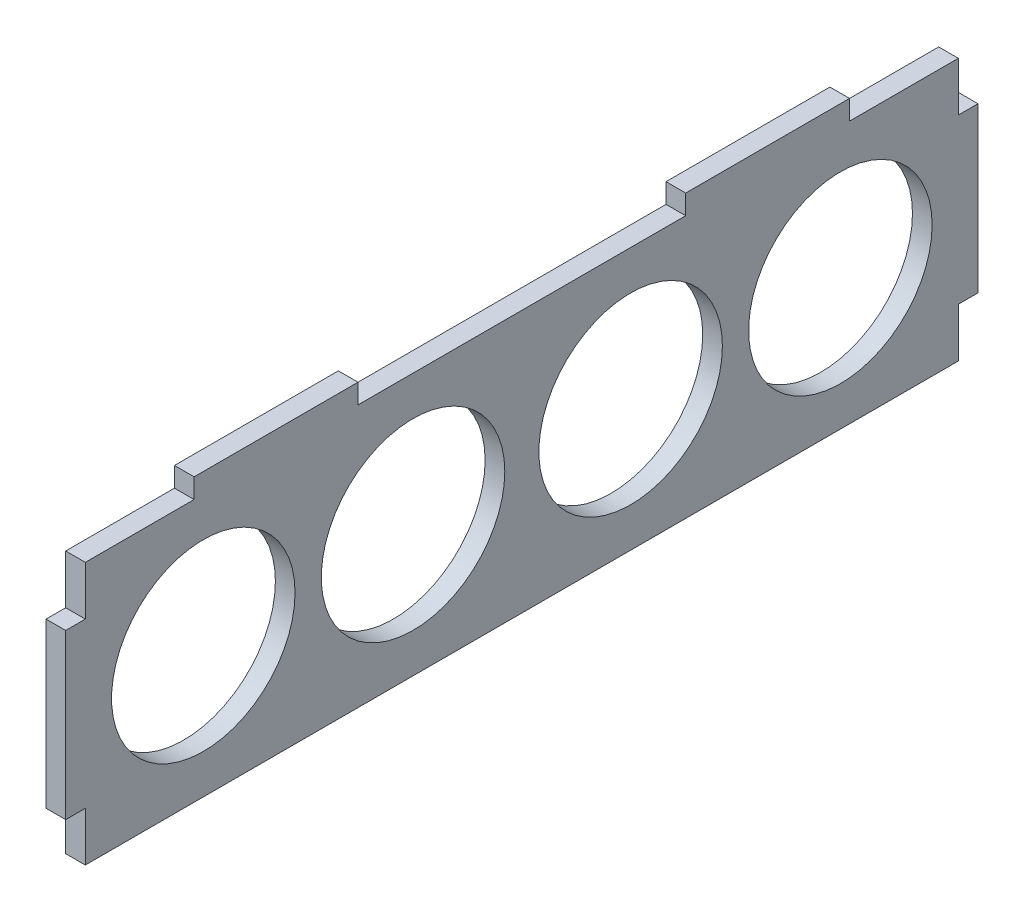
ISO-10303-21;
HEADER;
FILE_DESCRIPTION(('STEP AP214'),'2;1');
FILE_NAME('part.step','',(''),(''),'','','');
FILE_SCHEMA(('AUTOMOTIVE_DESIGN { 1 0 10303 214 1 1 1 1 }'));
ENDSEC;
DATA;
#1=APPLICATION_CONTEXT('core data for automotive mechanical design processes');
#2=APPLICATION_PROTOCOL_DEFINITION('international standard','automotive_design',2000,#1);
#3=PRODUCT_CONTEXT('',#1,'mechanical');
#4=PRODUCT('Part','Part','',(#3));
#5=PRODUCT_RELATED_PRODUCT_CATEGORY('part','',(#4));
#6=PRODUCT_DEFINITION_FORMATION('','',#4);
#7=PRODUCT_DEFINITION_CONTEXT('part definition',#1,'design');
#8=PRODUCT_DEFINITION('design','',#6,#7);
#9=PRODUCT_DEFINITION_SHAPE('','',#8);
#10=(LENGTH_UNIT() NAMED_UNIT(*) SI_UNIT(.MILLI.,.METRE.));
#11=(NAMED_UNIT(*) PLANE_ANGLE_UNIT() SI_UNIT($,.RADIAN.));
#12=(NAMED_UNIT(*) SI_UNIT($,.STERADIAN.) SOLID_ANGLE_UNIT());
#13=UNCERTAINTY_MEASURE_WITH_UNIT(LENGTH_MEASURE(1.E-05),#10,'distance_accuracy_value','');
#14=(GEOMETRIC_REPRESENTATION_CONTEXT(3) GLOBAL_UNCERTAINTY_ASSIGNED_CONTEXT((#13)) GLOBAL_UNIT_ASSIGNED_CONTEXT((#10,
#11,#12)) REPRESENTATION_CONTEXT('',''));
#15=CARTESIAN_POINT('',(0.,0.,0.));
#16=DIRECTION('',(0.,0.,1.));
#17=DIRECTION('',(1.,0.,0.));
#18=AXIS2_PLACEMENT_3D('',#15,#16,#17);
#19=CARTESIAN_POINT('',(3.,-20.,0.));
#20=DIRECTION('',(0.,1.,0.));
#21=DIRECTION('',(0.,0.,1.));
#22=AXIS2_PLACEMENT_3D('',#19,#20,#21);
#23=PLANE('',#22);
#24=DIRECTION('',(0.,0.,-1.));
#25=VECTOR('',#24,1.);
#26=CARTESIAN_POINT('',(0.,-20.,0.));
#27=LINE('',#26,#25);
#28=CARTESIAN_POINT('',(0.,-20.,66.6));
#29=VERTEX_POINT('',#28);
#30=CARTESIAN_POINT('',(0.,-20.,-66.6));
#31=VERTEX_POINT('',#30);
#32=EDGE_CURVE('E222',#29,#31,#27,.T.);
#33=ORIENTED_EDGE('',*,*,#32,.T.);
#34=DIRECTION('',(-1.,0.,0.));
#35=VECTOR('',#34,1.);
#36=CARTESIAN_POINT('',(3.,-20.,-66.6));
#37=LINE('',#36,#35);
#38=CARTESIAN_POINT('',(3.,-20.,-66.6));
#39=VERTEX_POINT('',#38);
#40=EDGE_CURVE('E11',#39,#31,#37,.T.);
#41=ORIENTED_EDGE('',*,*,#40,.F.);
#42=DIRECTION('',(0.,0.,-1.));
#43=VECTOR('',#42,1.);
#44=CARTESIAN_POINT('',(3.,-20.,0.));
#45=LINE('',#44,#43);
#46=CARTESIAN_POINT('',(3.,-20.,66.6));
#47=VERTEX_POINT('',#46);
#48=EDGE_CURVE('E674',#47,#39,#45,.T.);
#49=ORIENTED_EDGE('',*,*,#48,.F.);
#50=DIRECTION('',(-1.,0.,0.));
#51=VECTOR('',#50,1.);
#52=CARTESIAN_POINT('',(3.,-20.,66.6));
#53=LINE('',#52,#51);
#54=EDGE_CURVE('E55',#47,#29,#53,.T.);
#55=ORIENTED_EDGE('',*,*,#54,.T.);
#56=EDGE_LOOP('',(#33,#41,#49,#55));
#57=FACE_BOUND('',#56,.T.);
#58=ADVANCED_FACE('F38',(#57),#23,.F.);
#59=CARTESIAN_POINT('',(3.,0.,-66.6));
#60=DIRECTION('',(0.,0.,1.));
#61=DIRECTION('',(1.,0.,0.));
#62=AXIS2_PLACEMENT_3D('',#59,#60,#61);
#63=PLANE('',#62);
#64=DIRECTION('',(0.,1.,0.));
#65=VECTOR('',#64,1.);
#66=CARTESIAN_POINT('',(0.,0.,-66.6));
#67=LINE('',#66,#65);
#68=CARTESIAN_POINT('',(0.,-12.5,-66.6));
#69=VERTEX_POINT('',#68);
#70=EDGE_CURVE('E224',#31,#69,#67,.T.);
#71=ORIENTED_EDGE('',*,*,#70,.T.);
#72=DIRECTION('',(-1.,0.,0.));
#73=VECTOR('',#72,1.);
#74=CARTESIAN_POINT('',(3.,-12.5,-66.6));
#75=LINE('',#74,#73);
#76=CARTESIAN_POINT('',(3.,-12.5,-66.6));
#77=VERTEX_POINT('',#76);
#78=EDGE_CURVE('E47',#77,#69,#75,.T.);
#79=ORIENTED_EDGE('',*,*,#78,.F.);
#80=DIRECTION('',(0.,1.,0.));
#81=VECTOR('',#80,1.);
#82=CARTESIAN_POINT('',(3.,0.,-66.6));
#83=LINE('',#82,#81);
#84=EDGE_CURVE('E129',#39,#77,#83,.T.);
#85=ORIENTED_EDGE('',*,*,#84,.F.);
#86=ORIENTED_EDGE('',*,*,#40,.T.);
#87=EDGE_LOOP('',(#71,#79,#85,#86));
#88=FACE_BOUND('',#87,.T.);
#89=ADVANCED_FACE('F390',(#88),#63,.F.);
#90=CARTESIAN_POINT('',(3.,-12.5,0.));
#91=DIRECTION('',(0.,1.,0.));
#92=DIRECTION('',(0.,0.,1.));
#93=AXIS2_PLACEMENT_3D('',#90,#91,#92);
#94=PLANE('',#93);
#95=DIRECTION('',(0.,0.,-1.));
#96=VECTOR('',#95,1.);
#97=CARTESIAN_POINT('',(0.,-12.5,0.));
#98=LINE('',#97,#96);
#99=CARTESIAN_POINT('',(0.,-12.5,-69.6));
#100=VERTEX_POINT('',#99);
#101=EDGE_CURVE('E226',#69,#100,#98,.T.);
#102=ORIENTED_EDGE('',*,*,#101,.T.);
#103=DIRECTION('',(-1.,0.,0.));
#104=VECTOR('',#103,1.);
#105=CARTESIAN_POINT('',(3.,-12.5,-69.6));
#106=LINE('',#105,#104);
#107=CARTESIAN_POINT('',(3.,-12.5,-69.6));
#108=VERTEX_POINT('',#107);
#109=EDGE_CURVE('E297',#108,#100,#106,.T.);
#110=ORIENTED_EDGE('',*,*,#109,.F.);
#111=DIRECTION('',(0.,0.,-1.));
#112=VECTOR('',#111,1.);
#113=CARTESIAN_POINT('',(3.,-12.5,0.));
#114=LINE('',#113,#112);
#115=EDGE_CURVE('E304',#77,#108,#114,.T.);
#116=ORIENTED_EDGE('',*,*,#115,.F.);
#117=ORIENTED_EDGE('',*,*,#78,.T.);
#118=EDGE_LOOP('',(#102,#110,#116,#117));
#119=FACE_BOUND('',#118,.T.);
#120=ADVANCED_FACE('F302',(#119),#94,.F.);
#121=CARTESIAN_POINT('',(3.,0.,-69.6));
#122=DIRECTION('',(0.,0.,-1.));
#123=DIRECTION('',(-1.,0.,0.));
#124=AXIS2_PLACEMENT_3D('',#121,#122,#123);
#125=PLANE('',#124);
#126=DIRECTION('',(0.,-1.,0.));
#127=VECTOR('',#126,1.);
#128=CARTESIAN_POINT('',(0.,0.,-69.6));
#129=LINE('',#128,#127);
#130=CARTESIAN_POINT('',(0.,12.5,-69.6));
#131=VERTEX_POINT('',#130);
#132=EDGE_CURVE('E230',#131,#100,#129,.T.);
#133=ORIENTED_EDGE('',*,*,#132,.F.);
#134=DIRECTION('',(-1.,0.,0.));
#135=VECTOR('',#134,1.);
#136=CARTESIAN_POINT('',(3.,12.5,-69.6));
#137=LINE('',#136,#135);
#138=CARTESIAN_POINT('',(3.,12.5,-69.6));
#139=VERTEX_POINT('',#138);
#140=EDGE_CURVE('E295',#139,#131,#137,.T.);
#141=ORIENTED_EDGE('',*,*,#140,.F.);
#142=DIRECTION('',(0.,-1.,0.));
#143=VECTOR('',#142,1.);
#144=CARTESIAN_POINT('',(3.,0.,-69.6));
#145=LINE('',#144,#143);
#146=EDGE_CURVE('E314',#139,#108,#145,.T.);
#147=ORIENTED_EDGE('',*,*,#146,.T.);
#148=ORIENTED_EDGE('',*,*,#109,.T.);
#149=EDGE_LOOP('',(#133,#141,#147,#148));
#150=FACE_BOUND('',#149,.T.);
#151=ADVANCED_FACE('F311',(#150),#125,.T.);
#152=CARTESIAN_POINT('',(3.,12.5,0.));
#153=DIRECTION('',(0.,1.,0.));
#154=DIRECTION('',(0.,0.,1.));
#155=AXIS2_PLACEMENT_3D('',#152,#153,#154);
#156=PLANE('',#155);
#157=DIRECTION('',(0.,0.,-1.));
#158=VECTOR('',#157,1.);
#159=CARTESIAN_POINT('',(0.,12.5,0.));
#160=LINE('',#159,#158);
#161=CARTESIAN_POINT('',(0.,12.5,-66.6));
#162=VERTEX_POINT('',#161);
#163=EDGE_CURVE('E233',#162,#131,#160,.T.);
#164=ORIENTED_EDGE('',*,*,#163,.F.);
#165=DIRECTION('',(-1.,0.,0.));
#166=VECTOR('',#165,1.);
#167=CARTESIAN_POINT('',(3.,12.5,-66.6));
#168=LINE('',#167,#166);
#169=CARTESIAN_POINT('',(3.,12.5,-66.6));
#170=VERTEX_POINT('',#169);
#171=EDGE_CURVE('E293',#170,#162,#168,.T.);
#172=ORIENTED_EDGE('',*,*,#171,.F.);
#173=DIRECTION('',(0.,0.,-1.));
#174=VECTOR('',#173,1.);
#175=CARTESIAN_POINT('',(3.,12.5,0.));
#176=LINE('',#175,#174);
#177=EDGE_CURVE('E317',#170,#139,#176,.T.);
#178=ORIENTED_EDGE('',*,*,#177,.T.);
#179=ORIENTED_EDGE('',*,*,#140,.T.);
#180=EDGE_LOOP('',(#164,#172,#178,#179));
#181=FACE_BOUND('',#180,.T.);
#182=ADVANCED_FACE('F621',(#181),#156,.T.);
#183=CARTESIAN_POINT('',(0.,20.,-66.6));
#184=VERTEX_POINT('',#183);
#185=EDGE_CURVE('E227',#162,#184,#67,.T.);
#186=ORIENTED_EDGE('',*,*,#185,.T.);
#187=DIRECTION('',(-1.,0.,0.));
#188=VECTOR('',#187,1.);
#189=CARTESIAN_POINT('',(3.,20.,-66.6));
#190=LINE('',#189,#188);
#191=CARTESIAN_POINT('',(3.,20.,-66.6));
#192=VERTEX_POINT('',#191);
#193=EDGE_CURVE('E291',#192,#184,#190,.T.);
#194=ORIENTED_EDGE('',*,*,#193,.F.);
#195=EDGE_CURVE('E319',#170,#192,#83,.T.);
#196=ORIENTED_EDGE('',*,*,#195,.F.);
#197=ORIENTED_EDGE('',*,*,#171,.T.);
#198=EDGE_LOOP('',(#186,#194,#196,#197));
#199=FACE_BOUND('',#198,.T.);
#200=ADVANCED_FACE('F396',(#199),#63,.F.);
#201=CARTESIAN_POINT('',(3.,20.,0.));
#202=DIRECTION('',(0.,1.,0.));
#203=DIRECTION('',(0.,0.,1.));
#204=AXIS2_PLACEMENT_3D('',#201,#202,#203);
#205=PLANE('',#204);
#206=DIRECTION('',(0.,0.,-1.));
#207=VECTOR('',#206,1.);
#208=CARTESIAN_POINT('',(0.,20.,0.));
#209=LINE('',#208,#207);
#210=CARTESIAN_POINT('',(0.,20.,-50.));
#211=VERTEX_POINT('',#210);
#212=EDGE_CURVE('E236',#211,#184,#209,.T.);
#213=ORIENTED_EDGE('',*,*,#212,.F.);
#214=DIRECTION('',(-1.,0.,0.));
#215=VECTOR('',#214,1.);
#216=CARTESIAN_POINT('',(3.,20.,-50.));
#217=LINE('',#216,#215);
#218=CARTESIAN_POINT('',(3.,20.,-50.));
#219=VERTEX_POINT('',#218);
#220=EDGE_CURVE('E289',#219,#211,#217,.T.);
#221=ORIENTED_EDGE('',*,*,#220,.F.);
#222=DIRECTION('',(0.,0.,-1.));
#223=VECTOR('',#222,1.);
#224=CARTESIAN_POINT('',(3.,20.,0.));
#225=LINE('',#224,#223);
#226=EDGE_CURVE('E324',#219,#192,#225,.T.);
#227=ORIENTED_EDGE('',*,*,#226,.T.);
#228=ORIENTED_EDGE('',*,*,#193,.T.);
#229=EDGE_LOOP('',(#213,#221,#227,#228));
#230=FACE_BOUND('',#229,.T.);
#231=ADVANCED_FACE('F387',(#230),#205,.T.);
#232=CARTESIAN_POINT('',(3.,0.,-50.));
#233=DIRECTION('',(0.,0.,1.));
#234=DIRECTION('',(1.,0.,0.));
#235=AXIS2_PLACEMENT_3D('',#232,#233,#234);
#236=PLANE('',#235);
#237=DIRECTION('',(0.,1.,0.));
#238=VECTOR('',#237,1.);
#239=CARTESIAN_POINT('',(0.,0.,-50.));
#240=LINE('',#239,#238);
#241=CARTESIAN_POINT('',(0.,23.,-50.));
#242=VERTEX_POINT('',#241);
#243=EDGE_CURVE('E239',#211,#242,#240,.T.);
#244=ORIENTED_EDGE('',*,*,#243,.T.);
#245=DIRECTION('',(-1.,0.,0.));
#246=VECTOR('',#245,1.);
#247=CARTESIAN_POINT('',(3.,23.,-50.));
#248=LINE('',#247,#246);
#249=CARTESIAN_POINT('',(3.,23.,-50.));
#250=VERTEX_POINT('',#249);
#251=EDGE_CURVE('E287',#250,#242,#248,.T.);
#252=ORIENTED_EDGE('',*,*,#251,.F.);
#253=DIRECTION('',(0.,1.,0.));
#254=VECTOR('',#253,1.);
#255=CARTESIAN_POINT('',(3.,0.,-50.));
#256=LINE('',#255,#254);
#257=EDGE_CURVE('E327',#219,#250,#256,.T.);
#258=ORIENTED_EDGE('',*,*,#257,.F.);
#259=ORIENTED_EDGE('',*,*,#220,.T.);
#260=EDGE_LOOP('',(#244,#252,#258,#259));
#261=FACE_BOUND('',#260,.T.);
#262=ADVANCED_FACE('F593',(#261),#236,.F.);
#263=CARTESIAN_POINT('',(3.,23.,0.));
#264=DIRECTION('',(0.,1.,0.));
#265=DIRECTION('',(0.,0.,1.));
#266=AXIS2_PLACEMENT_3D('',#263,#264,#265);
#267=PLANE('',#266);
#268=DIRECTION('',(0.,0.,-1.));
#269=VECTOR('',#268,1.);
#270=CARTESIAN_POINT('',(0.,23.,0.));
#271=LINE('',#270,#269);
#272=CARTESIAN_POINT('',(0.,23.,-25.));
#273=VERTEX_POINT('',#272);
#274=EDGE_CURVE('E244',#273,#242,#271,.T.);
#275=ORIENTED_EDGE('',*,*,#274,.F.);
#276=DIRECTION('',(-1.,0.,0.));
#277=VECTOR('',#276,1.);
#278=CARTESIAN_POINT('',(3.,23.,-25.));
#279=LINE('',#278,#277);
#280=CARTESIAN_POINT('',(3.,23.,-25.));
#281=VERTEX_POINT('',#280);
#282=EDGE_CURVE('E285',#281,#273,#279,.T.);
#283=ORIENTED_EDGE('',*,*,#282,.F.);
#284=DIRECTION('',(0.,0.,-1.));
#285=VECTOR('',#284,1.);
#286=CARTESIAN_POINT('',(3.,23.,0.));
#287=LINE('',#286,#285);
#288=EDGE_CURVE('E331',#281,#250,#287,.T.);
#289=ORIENTED_EDGE('',*,*,#288,.T.);
#290=ORIENTED_EDGE('',*,*,#251,.T.);
#291=EDGE_LOOP('',(#275,#283,#289,#290));
#292=FACE_BOUND('',#291,.T.);
#293=ADVANCED_FACE('F585',(#292),#267,.T.);
#294=CARTESIAN_POINT('',(3.,0.,-25.));
#295=DIRECTION('',(0.,0.,1.));
#296=DIRECTION('',(1.,0.,0.));
#297=AXIS2_PLACEMENT_3D('',#294,#295,#296);
#298=PLANE('',#297);
#299=DIRECTION('',(0.,1.,0.));
#300=VECTOR('',#299,1.);
#301=CARTESIAN_POINT('',(0.,0.,-25.));
#302=LINE('',#301,#300);
#303=CARTESIAN_POINT('',(0.,20.,-25.));
#304=VERTEX_POINT('',#303);
#305=EDGE_CURVE('E247',#304,#273,#302,.T.);
#306=ORIENTED_EDGE('',*,*,#305,.F.);
#307=DIRECTION('',(-1.,0.,0.));
#308=VECTOR('',#307,1.);
#309=CARTESIAN_POINT('',(3.,20.,-25.));
#310=LINE('',#309,#308);
#311=CARTESIAN_POINT('',(3.,20.,-25.));
#312=VERTEX_POINT('',#311);
#313=EDGE_CURVE('E283',#312,#304,#310,.T.);
#314=ORIENTED_EDGE('',*,*,#313,.F.);
#315=DIRECTION('',(0.,1.,0.));
#316=VECTOR('',#315,1.);
#317=CARTESIAN_POINT('',(3.,0.,-25.));
#318=LINE('',#317,#316);
#319=EDGE_CURVE('E334',#312,#281,#318,.T.);
#320=ORIENTED_EDGE('',*,*,#319,.T.);
#321=ORIENTED_EDGE('',*,*,#282,.T.);
#322=EDGE_LOOP('',(#306,#314,#320,#321));
#323=FACE_BOUND('',#322,.T.);
#324=ADVANCED_FACE('F361',(#323),#298,.T.);
#325=CARTESIAN_POINT('',(0.,20.,25.));
#326=VERTEX_POINT('',#325);
#327=EDGE_CURVE('E241',#326,#304,#209,.T.);
#328=ORIENTED_EDGE('',*,*,#327,.F.);
#329=DIRECTION('',(-1.,0.,0.));
#330=VECTOR('',#329,1.);
#331=CARTESIAN_POINT('',(3.,20.,25.));
#332=LINE('',#331,#330);
#333=CARTESIAN_POINT('',(3.,20.,25.));
#334=VERTEX_POINT('',#333);
#335=EDGE_CURVE('E281',#334,#326,#332,.T.);
#336=ORIENTED_EDGE('',*,*,#335,.F.);
#337=EDGE_CURVE('E329',#334,#312,#225,.T.);
#338=ORIENTED_EDGE('',*,*,#337,.T.);
#339=ORIENTED_EDGE('',*,*,#313,.T.);
#340=EDGE_LOOP('',(#328,#336,#338,#339));
#341=FACE_BOUND('',#340,.T.);
#342=ADVANCED_FACE('F353',(#341),#205,.T.);
#343=CARTESIAN_POINT('',(3.,0.,25.));
#344=DIRECTION('',(0.,0.,1.));
#345=DIRECTION('',(1.,0.,0.));
#346=AXIS2_PLACEMENT_3D('',#343,#344,#345);
#347=PLANE('',#346);
#348=DIRECTION('',(0.,1.,0.));
#349=VECTOR('',#348,1.);
#350=CARTESIAN_POINT('',(0.,0.,25.));
#351=LINE('',#350,#349);
#352=CARTESIAN_POINT('',(0.,23.,25.));
#353=VERTEX_POINT('',#352);
#354=EDGE_CURVE('E250',#326,#353,#351,.T.);
#355=ORIENTED_EDGE('',*,*,#354,.T.);
#356=DIRECTION('',(-1.,0.,0.));
#357=VECTOR('',#356,1.);
#358=CARTESIAN_POINT('',(3.,23.,25.));
#359=LINE('',#358,#357);
#360=CARTESIAN_POINT('',(3.,23.,25.));
#361=VERTEX_POINT('',#360);
#362=EDGE_CURVE('E279',#361,#353,#359,.T.);
#363=ORIENTED_EDGE('',*,*,#362,.F.);
#364=DIRECTION('',(0.,1.,0.));
#365=VECTOR('',#364,1.);
#366=CARTESIAN_POINT('',(3.,0.,25.));
#367=LINE('',#366,#365);
#368=EDGE_CURVE('E337',#334,#361,#367,.T.);
#369=ORIENTED_EDGE('',*,*,#368,.F.);
#370=ORIENTED_EDGE('',*,*,#335,.T.);
#371=EDGE_LOOP('',(#355,#363,#369,#370));
#372=FACE_BOUND('',#371,.T.);
#373=ADVANCED_FACE('F378',(#372),#347,.F.);
#374=CARTESIAN_POINT('',(3.,23.,0.));
#375=DIRECTION('',(0.,1.,0.));
#376=DIRECTION('',(0.,0.,1.));
#377=AXIS2_PLACEMENT_3D('',#374,#375,#376);
#378=PLANE('',#377);
#379=DIRECTION('',(0.,0.,-1.));
#380=VECTOR('',#379,1.);
#381=CARTESIAN_POINT('',(0.,23.,0.));
#382=LINE('',#381,#380);
#383=CARTESIAN_POINT('',(0.,23.,50.));
#384=VERTEX_POINT('',#383);
#385=EDGE_CURVE('E253',#384,#353,#382,.T.);
#386=ORIENTED_EDGE('',*,*,#385,.F.);
#387=DIRECTION('',(-1.,0.,0.));
#388=VECTOR('',#387,1.);
#389=CARTESIAN_POINT('',(3.,23.,50.));
#390=LINE('',#389,#388);
#391=CARTESIAN_POINT('',(3.,23.,50.));
#392=VERTEX_POINT('',#391);
#393=EDGE_CURVE('E277',#392,#384,#390,.T.);
#394=ORIENTED_EDGE('',*,*,#393,.F.);
#395=DIRECTION('',(0.,0.,-1.));
#396=VECTOR('',#395,1.);
#397=CARTESIAN_POINT('',(3.,23.,0.));
#398=LINE('',#397,#396);
#399=EDGE_CURVE('E339',#392,#361,#398,.T.);
#400=ORIENTED_EDGE('',*,*,#399,.T.);
#401=ORIENTED_EDGE('',*,*,#362,.T.);
#402=EDGE_LOOP('',(#386,#394,#400,#401));
#403=FACE_BOUND('',#402,.T.);
#404=ADVANCED_FACE('F376',(#403),#378,.T.);
#405=CARTESIAN_POINT('',(3.,0.,50.));
#406=DIRECTION('',(0.,0.,1.));
#407=DIRECTION('',(1.,0.,0.));
#408=AXIS2_PLACEMENT_3D('',#405,#406,#407);
#409=PLANE('',#408);
#410=DIRECTION('',(0.,1.,0.));
#411=VECTOR('',#410,1.);
#412=CARTESIAN_POINT('',(0.,0.,50.));
#413=LINE('',#412,#411);
#414=CARTESIAN_POINT('',(0.,20.,50.));
#415=VERTEX_POINT('',#414);
#416=EDGE_CURVE('E256',#415,#384,#413,.T.);
#417=ORIENTED_EDGE('',*,*,#416,.F.);
#418=DIRECTION('',(-1.,0.,0.));
#419=VECTOR('',#418,1.);
#420=CARTESIAN_POINT('',(3.,20.,50.));
#421=LINE('',#420,#419);
#422=CARTESIAN_POINT('',(3.,20.,50.));
#423=VERTEX_POINT('',#422);
#424=EDGE_CURVE('E275',#423,#415,#421,.T.);
#425=ORIENTED_EDGE('',*,*,#424,.F.);
#426=DIRECTION('',(0.,1.,0.));
#427=VECTOR('',#426,1.);
#428=CARTESIAN_POINT('',(3.,0.,50.));
#429=LINE('',#428,#427);
#430=EDGE_CURVE('E342',#423,#392,#429,.T.);
#431=ORIENTED_EDGE('',*,*,#430,.T.);
#432=ORIENTED_EDGE('',*,*,#393,.T.);
#433=EDGE_LOOP('',(#417,#425,#431,#432));
#434=FACE_BOUND('',#433,.T.);
#435=ADVANCED_FACE('F373',(#434),#409,.T.);
#436=CARTESIAN_POINT('',(0.,20.,66.6));
#437=VERTEX_POINT('',#436);
#438=EDGE_CURVE('E240',#437,#415,#209,.T.);
#439=ORIENTED_EDGE('',*,*,#438,.F.);
#440=DIRECTION('',(-1.,0.,0.));
#441=VECTOR('',#440,1.);
#442=CARTESIAN_POINT('',(3.,20.,66.6));
#443=LINE('',#442,#441);
#444=CARTESIAN_POINT('',(3.,20.,66.6));
#445=VERTEX_POINT('',#444);
#446=EDGE_CURVE('E273',#445,#437,#443,.T.);
#447=ORIENTED_EDGE('',*,*,#446,.F.);
#448=EDGE_CURVE('E328',#445,#423,#225,.T.);
#449=ORIENTED_EDGE('',*,*,#448,.T.);
#450=ORIENTED_EDGE('',*,*,#424,.T.);
#451=EDGE_LOOP('',(#439,#447,#449,#450));
#452=FACE_BOUND('',#451,.T.);
#453=ADVANCED_FACE('F370',(#452),#205,.T.);
#454=CARTESIAN_POINT('',(3.,0.,66.6));
#455=DIRECTION('',(0.,0.,1.));
#456=DIRECTION('',(1.,0.,0.));
#457=AXIS2_PLACEMENT_3D('',#454,#455,#456);
#458=PLANE('',#457);
#459=DIRECTION('',(0.,1.,0.));
#460=VECTOR('',#459,1.);
#461=CARTESIAN_POINT('',(0.,0.,66.6));
#462=LINE('',#461,#460);
#463=CARTESIAN_POINT('',(0.,12.5,66.6));
#464=VERTEX_POINT('',#463);
#465=EDGE_CURVE('E259',#464,#437,#462,.T.);
#466=ORIENTED_EDGE('',*,*,#465,.F.);
#467=DIRECTION('',(-1.,0.,0.));
#468=VECTOR('',#467,1.);
#469=CARTESIAN_POINT('',(3.,12.5,66.6));
#470=LINE('',#469,#468);
#471=CARTESIAN_POINT('',(3.,12.5,66.6));
#472=VERTEX_POINT('',#471);
#473=EDGE_CURVE('E271',#472,#464,#470,.T.);
#474=ORIENTED_EDGE('',*,*,#473,.F.);
#475=DIRECTION('',(0.,1.,0.));
#476=VECTOR('',#475,1.);
#477=CARTESIAN_POINT('',(3.,0.,66.6));
#478=LINE('',#477,#476);
#479=EDGE_CURVE('E207',#472,#445,#478,.T.);
#480=ORIENTED_EDGE('',*,*,#479,.T.);
#481=ORIENTED_EDGE('',*,*,#446,.T.);
#482=EDGE_LOOP('',(#466,#474,#480,#481));
#483=FACE_BOUND('',#482,.T.);
#484=ADVANCED_FACE('F438',(#483),#458,.T.);
#485=CARTESIAN_POINT('',(3.,12.5,0.));
#486=DIRECTION('',(0.,-1.,0.));
#487=DIRECTION('',(0.,0.,-1.));
#488=AXIS2_PLACEMENT_3D('',#485,#486,#487);
#489=PLANE('',#488);
#490=DIRECTION('',(0.,0.,1.));
#491=VECTOR('',#490,1.);
#492=CARTESIAN_POINT('',(0.,12.5,0.));
#493=LINE('',#492,#491);
#494=CARTESIAN_POINT('',(0.,12.5,69.6));
#495=VERTEX_POINT('',#494);
#496=EDGE_CURVE('E262',#464,#495,#493,.T.);
#497=ORIENTED_EDGE('',*,*,#496,.T.);
#498=DIRECTION('',(-1.,0.,0.));
#499=VECTOR('',#498,1.);
#500=CARTESIAN_POINT('',(3.,12.5,69.6));
#501=LINE('',#500,#499);
#502=CARTESIAN_POINT('',(3.,12.5,69.6));
#503=VERTEX_POINT('',#502);
#504=EDGE_CURVE('E201',#503,#495,#501,.T.);
#505=ORIENTED_EDGE('',*,*,#504,.F.);
#506=DIRECTION('',(0.,0.,1.));
#507=VECTOR('',#506,1.);
#508=CARTESIAN_POINT('',(3.,12.5,0.));
#509=LINE('',#508,#507);
#510=EDGE_CURVE('E189',#472,#503,#509,.T.);
#511=ORIENTED_EDGE('',*,*,#510,.F.);
#512=ORIENTED_EDGE('',*,*,#473,.T.);
#513=EDGE_LOOP('',(#497,#505,#511,#512));
#514=FACE_BOUND('',#513,.T.);
#515=ADVANCED_FACE('F443',(#514),#489,.F.);
#516=CARTESIAN_POINT('',(3.,0.,69.6));
#517=DIRECTION('',(0.,0.,-1.));
#518=DIRECTION('',(-1.,0.,0.));
#519=AXIS2_PLACEMENT_3D('',#516,#517,#518);
#520=PLANE('',#519);
#521=DIRECTION('',(0.,-1.,0.));
#522=VECTOR('',#521,1.);
#523=CARTESIAN_POINT('',(0.,0.,69.6));
#524=LINE('',#523,#522);
#525=CARTESIAN_POINT('',(0.,-12.5,69.6));
#526=VERTEX_POINT('',#525);
#527=EDGE_CURVE('E198',#495,#526,#524,.T.);
#528=ORIENTED_EDGE('',*,*,#527,.T.);
#529=DIRECTION('',(-1.,0.,0.));
#530=VECTOR('',#529,1.);
#531=CARTESIAN_POINT('',(3.,-12.5,69.6));
#532=LINE('',#531,#530);
#533=CARTESIAN_POINT('',(3.,-12.5,69.6));
#534=VERTEX_POINT('',#533);
#535=EDGE_CURVE('E195',#534,#526,#532,.T.);
#536=ORIENTED_EDGE('',*,*,#535,.F.);
#537=DIRECTION('',(0.,-1.,0.));
#538=VECTOR('',#537,1.);
#539=CARTESIAN_POINT('',(3.,0.,69.6));
#540=LINE('',#539,#538);
#541=EDGE_CURVE('E181',#503,#534,#540,.T.);
#542=ORIENTED_EDGE('',*,*,#541,.F.);
#543=ORIENTED_EDGE('',*,*,#504,.T.);
#544=EDGE_LOOP('',(#528,#536,#542,#543));
#545=FACE_BOUND('',#544,.T.);
#546=ADVANCED_FACE('F196',(#545),#520,.F.);
#547=CARTESIAN_POINT('',(3.,-12.5,0.));
#548=DIRECTION('',(0.,-1.,0.));
#549=DIRECTION('',(0.,0.,-1.));
#550=AXIS2_PLACEMENT_3D('',#547,#548,#549);
#551=PLANE('',#550);
#552=DIRECTION('',(0.,0.,1.));
#553=VECTOR('',#552,1.);
#554=CARTESIAN_POINT('',(0.,-12.5,0.));
#555=LINE('',#554,#553);
#556=CARTESIAN_POINT('',(0.,-12.5,66.6));
#557=VERTEX_POINT('',#556);
#558=EDGE_CURVE('E266',#557,#526,#555,.T.);
#559=ORIENTED_EDGE('',*,*,#558,.F.);
#560=DIRECTION('',(-1.,0.,0.));
#561=VECTOR('',#560,1.);
#562=CARTESIAN_POINT('',(3.,-12.5,66.6));
#563=LINE('',#562,#561);
#564=CARTESIAN_POINT('',(3.,-12.5,66.6));
#565=VERTEX_POINT('',#564);
#566=EDGE_CURVE('E117',#565,#557,#563,.T.);
#567=ORIENTED_EDGE('',*,*,#566,.F.);
#568=DIRECTION('',(0.,0.,1.));
#569=VECTOR('',#568,1.);
#570=CARTESIAN_POINT('',(3.,-12.5,0.));
#571=LINE('',#570,#569);
#572=EDGE_CURVE('E186',#565,#534,#571,.T.);
#573=ORIENTED_EDGE('',*,*,#572,.T.);
#574=ORIENTED_EDGE('',*,*,#535,.T.);
#575=EDGE_LOOP('',(#559,#567,#573,#574));
#576=FACE_BOUND('',#575,.T.);
#577=ADVANCED_FACE('F203',(#576),#551,.T.);
#578=CARTESIAN_POINT('',(3.,0.,48.6));
#579=DIRECTION('',(-1.,0.,0.));
#580=DIRECTION('',(0.,0.,1.));
#581=AXIS2_PLACEMENT_3D('',#578,#579,#580);
#582=CYLINDRICAL_SURFACE('',#581,14.);
#583=CARTESIAN_POINT('',(3.,0.,48.6));
#584=DIRECTION('',(1.,0.,0.));
#585=DIRECTION('',(0.,0.,-1.));
#586=AXIS2_PLACEMENT_3D('',#583,#584,#585);
#587=CIRCLE('',#586,14.);
#588=CARTESIAN_POINT('',(3.,0.,34.6));
#589=VERTEX_POINT('',#588);
#590=EDGE_CURVE('E675',#589,#589,#587,.T.);
#591=ORIENTED_EDGE('',*,*,#590,.T.);
#592=EDGE_LOOP('',(#591));
#593=FACE_BOUND('',#592,.T.);
#594=CARTESIAN_POINT('',(0.,0.,48.6));
#595=DIRECTION('',(1.,0.,0.));
#596=DIRECTION('',(0.,0.,-1.));
#597=AXIS2_PLACEMENT_3D('',#594,#595,#596);
#598=CIRCLE('',#597,14.);
#599=CARTESIAN_POINT('',(0.,0.,34.6));
#600=VERTEX_POINT('',#599);
#601=EDGE_CURVE('E219',#600,#600,#598,.T.);
#602=ORIENTED_EDGE('',*,*,#601,.F.);
#603=EDGE_LOOP('',(#602));
#604=FACE_BOUND('',#603,.T.);
#605=ADVANCED_FACE('F400',(#593,#604),#582,.F.);
#606=CARTESIAN_POINT('',(3.,0.,-48.6));
#607=DIRECTION('',(-1.,0.,0.));
#608=DIRECTION('',(0.,0.,1.));
#609=AXIS2_PLACEMENT_3D('',#606,#607,#608);
#610=CYLINDRICAL_SURFACE('',#609,14.);
#611=CARTESIAN_POINT('',(3.,0.,-48.6));
#612=DIRECTION('',(1.,0.,0.));
#613=DIRECTION('',(0.,0.,-1.));
#614=AXIS2_PLACEMENT_3D('',#611,#612,#613);
#615=CIRCLE('',#614,14.);
#616=CARTESIAN_POINT('',(3.,0.,-62.6));
#617=VERTEX_POINT('',#616);
#618=EDGE_CURVE('E678',#617,#617,#615,.T.);
#619=ORIENTED_EDGE('',*,*,#618,.T.);
#620=EDGE_LOOP('',(#619));
#621=FACE_BOUND('',#620,.T.);
#622=CARTESIAN_POINT('',(0.,0.,-48.6));
#623=DIRECTION('',(1.,0.,0.));
#624=DIRECTION('',(0.,0.,-1.));
#625=AXIS2_PLACEMENT_3D('',#622,#623,#624);
#626=CIRCLE('',#625,14.);
#627=CARTESIAN_POINT('',(0.,0.,-62.6));
#628=VERTEX_POINT('',#627);
#629=EDGE_CURVE('E216',#628,#628,#626,.T.);
#630=ORIENTED_EDGE('',*,*,#629,.F.);
#631=EDGE_LOOP('',(#630));
#632=FACE_BOUND('',#631,.T.);
#633=ADVANCED_FACE('F403',(#621,#632),#610,.F.);
#634=CARTESIAN_POINT('',(3.,0.,16.6));
#635=DIRECTION('',(-1.,0.,0.));
#636=DIRECTION('',(0.,0.,1.));
#637=AXIS2_PLACEMENT_3D('',#634,#635,#636);
#638=CYLINDRICAL_SURFACE('',#637,14.);
#639=CARTESIAN_POINT('',(3.,0.,16.6));
#640=DIRECTION('',(1.,0.,0.));
#641=DIRECTION('',(0.,0.,-1.));
#642=AXIS2_PLACEMENT_3D('',#639,#640,#641);
#643=CIRCLE('',#642,14.);
#644=CARTESIAN_POINT('',(3.,0.,2.6));
#645=VERTEX_POINT('',#644);
#646=EDGE_CURVE('E418',#645,#645,#643,.T.);
#647=ORIENTED_EDGE('',*,*,#646,.T.);
#648=EDGE_LOOP('',(#647));
#649=FACE_BOUND('',#648,.T.);
#650=CARTESIAN_POINT('',(0.,0.,16.6));
#651=DIRECTION('',(1.,0.,0.));
#652=DIRECTION('',(0.,0.,-1.));
#653=AXIS2_PLACEMENT_3D('',#650,#651,#652);
#654=CIRCLE('',#653,14.);
#655=CARTESIAN_POINT('',(0.,0.,2.6));
#656=VERTEX_POINT('',#655);
#657=EDGE_CURVE('E213',#656,#656,#654,.T.);
#658=ORIENTED_EDGE('',*,*,#657,.F.);
#659=EDGE_LOOP('',(#658));
#660=FACE_BOUND('',#659,.T.);
#661=ADVANCED_FACE('F406',(#649,#660),#638,.F.);
#662=CARTESIAN_POINT('',(3.,0.,-16.6));
#663=DIRECTION('',(-1.,0.,0.));
#664=DIRECTION('',(0.,0.,1.));
#665=AXIS2_PLACEMENT_3D('',#662,#663,#664);
#666=CYLINDRICAL_SURFACE('',#665,14.);
#667=CARTESIAN_POINT('',(3.,0.,-16.6));
#668=DIRECTION('',(1.,0.,0.));
#669=DIRECTION('',(0.,0.,-1.));
#670=AXIS2_PLACEMENT_3D('',#667,#668,#669);
#671=CIRCLE('',#670,14.);
#672=CARTESIAN_POINT('',(3.,0.,-30.6));
#673=VERTEX_POINT('',#672);
#674=EDGE_CURVE('E684',#673,#673,#671,.T.);
#675=ORIENTED_EDGE('',*,*,#674,.T.);
#676=EDGE_LOOP('',(#675));
#677=FACE_BOUND('',#676,.T.);
#678=CARTESIAN_POINT('',(0.,0.,-16.6));
#679=DIRECTION('',(1.,0.,0.));
#680=DIRECTION('',(0.,0.,-1.));
#681=AXIS2_PLACEMENT_3D('',#678,#679,#680);
#682=CIRCLE('',#681,14.);
#683=CARTESIAN_POINT('',(0.,0.,-30.6));
#684=VERTEX_POINT('',#683);
#685=EDGE_CURVE('E210',#684,#684,#682,.T.);
#686=ORIENTED_EDGE('',*,*,#685,.F.);
#687=EDGE_LOOP('',(#686));
#688=FACE_BOUND('',#687,.T.);
#689=ADVANCED_FACE('F40',(#677,#688),#666,.F.);
#690=EDGE_CURVE('E263',#29,#557,#462,.T.);
#691=ORIENTED_EDGE('',*,*,#690,.F.);
#692=ORIENTED_EDGE('',*,*,#54,.F.);
#693=EDGE_CURVE('E204',#47,#565,#478,.T.);
#694=ORIENTED_EDGE('',*,*,#693,.T.);
#695=ORIENTED_EDGE('',*,*,#566,.T.);
#696=EDGE_LOOP('',(#691,#692,#694,#695));
#697=FACE_BOUND('',#696,.T.);
#698=ADVANCED_FACE('F413',(#697),#458,.T.);
#699=CARTESIAN_POINT('',(3.,0.,0.));
#700=DIRECTION('',(1.,0.,0.));
#701=DIRECTION('',(0.,0.,-1.));
#702=AXIS2_PLACEMENT_3D('',#699,#700,#701);
#703=PLANE('',#702);
#704=ORIENTED_EDGE('',*,*,#674,.F.);
#705=EDGE_LOOP('',(#704));
#706=FACE_BOUND('',#705,.T.);
#707=ORIENTED_EDGE('',*,*,#646,.F.);
#708=EDGE_LOOP('',(#707));
#709=FACE_BOUND('',#708,.T.);
#710=ORIENTED_EDGE('',*,*,#618,.F.);
#711=EDGE_LOOP('',(#710));
#712=FACE_BOUND('',#711,.T.);
#713=ORIENTED_EDGE('',*,*,#590,.F.);
#714=EDGE_LOOP('',(#713));
#715=FACE_BOUND('',#714,.T.);
#716=ORIENTED_EDGE('',*,*,#48,.T.);
#717=ORIENTED_EDGE('',*,*,#84,.T.);
#718=ORIENTED_EDGE('',*,*,#115,.T.);
#719=ORIENTED_EDGE('',*,*,#146,.F.);
#720=ORIENTED_EDGE('',*,*,#177,.F.);
#721=ORIENTED_EDGE('',*,*,#195,.T.);
#722=ORIENTED_EDGE('',*,*,#226,.F.);
#723=ORIENTED_EDGE('',*,*,#257,.T.);
#724=ORIENTED_EDGE('',*,*,#288,.F.);
#725=ORIENTED_EDGE('',*,*,#319,.F.);
#726=ORIENTED_EDGE('',*,*,#337,.F.);
#727=ORIENTED_EDGE('',*,*,#368,.T.);
#728=ORIENTED_EDGE('',*,*,#399,.F.);
#729=ORIENTED_EDGE('',*,*,#430,.F.);
#730=ORIENTED_EDGE('',*,*,#448,.F.);
#731=ORIENTED_EDGE('',*,*,#479,.F.);
#732=ORIENTED_EDGE('',*,*,#510,.T.);
#733=ORIENTED_EDGE('',*,*,#541,.T.);
#734=ORIENTED_EDGE('',*,*,#572,.F.);
#735=ORIENTED_EDGE('',*,*,#693,.F.);
#736=EDGE_LOOP('',(#716,#717,#718,#719,#720,#721,#722,#723,#724,#725,#726,#727,#728,#729,#730,
#731,#732,#733,#734,#735));
#737=FACE_BOUND('',#736,.T.);
#738=ADVANCED_FACE('F183',(#706,#709,#712,#715,#737),#703,.T.);
#739=CARTESIAN_POINT('',(0.,0.,0.));
#740=DIRECTION('',(1.,0.,0.));
#741=DIRECTION('',(0.,0.,-1.));
#742=AXIS2_PLACEMENT_3D('',#739,#740,#741);
#743=PLANE('',#742);
#744=ORIENTED_EDGE('',*,*,#685,.T.);
#745=EDGE_LOOP('',(#744));
#746=FACE_BOUND('',#745,.T.);
#747=ORIENTED_EDGE('',*,*,#657,.T.);
#748=EDGE_LOOP('',(#747));
#749=FACE_BOUND('',#748,.T.);
#750=ORIENTED_EDGE('',*,*,#629,.T.);
#751=EDGE_LOOP('',(#750));
#752=FACE_BOUND('',#751,.T.);
#753=ORIENTED_EDGE('',*,*,#601,.T.);
#754=EDGE_LOOP('',(#753));
#755=FACE_BOUND('',#754,.T.);
#756=ORIENTED_EDGE('',*,*,#32,.F.);
#757=ORIENTED_EDGE('',*,*,#690,.T.);
#758=ORIENTED_EDGE('',*,*,#558,.T.);
#759=ORIENTED_EDGE('',*,*,#527,.F.);
#760=ORIENTED_EDGE('',*,*,#496,.F.);
#761=ORIENTED_EDGE('',*,*,#465,.T.);
#762=ORIENTED_EDGE('',*,*,#438,.T.);
#763=ORIENTED_EDGE('',*,*,#416,.T.);
#764=ORIENTED_EDGE('',*,*,#385,.T.);
#765=ORIENTED_EDGE('',*,*,#354,.F.);
#766=ORIENTED_EDGE('',*,*,#327,.T.);
#767=ORIENTED_EDGE('',*,*,#305,.T.);
#768=ORIENTED_EDGE('',*,*,#274,.T.);
#769=ORIENTED_EDGE('',*,*,#243,.F.);
#770=ORIENTED_EDGE('',*,*,#212,.T.);
#771=ORIENTED_EDGE('',*,*,#185,.F.);
#772=ORIENTED_EDGE('',*,*,#163,.T.);
#773=ORIENTED_EDGE('',*,*,#132,.T.);
#774=ORIENTED_EDGE('',*,*,#101,.F.);
#775=ORIENTED_EDGE('',*,*,#70,.F.);
#776=EDGE_LOOP('',(#756,#757,#758,#759,#760,#761,#762,#763,#764,#765,#766,#767,#768,#769,#770,
#771,#772,#773,#774,#775));
#777=FACE_BOUND('',#776,.T.);
#778=ADVANCED_FACE('F306',(#746,#749,#752,#755,#777),#743,.F.);
#779=CLOSED_SHELL('',(#58,#89,#120,#151,#182,#200,#231,#262,#293,#324,#342,#373,#404,#435,#453,
#484,#515,#546,#577,#605,#633,#661,#689,#698,#738,#778));
#780=MANIFOLD_SOLID_BREP('B2',#779);
#781=ADVANCED_BREP_SHAPE_REPRESENTATION('',(#18,#780),#14);
#782=SHAPE_DEFINITION_REPRESENTATION(#9,#781);
ENDSEC;
END-ISO-10303-21;
